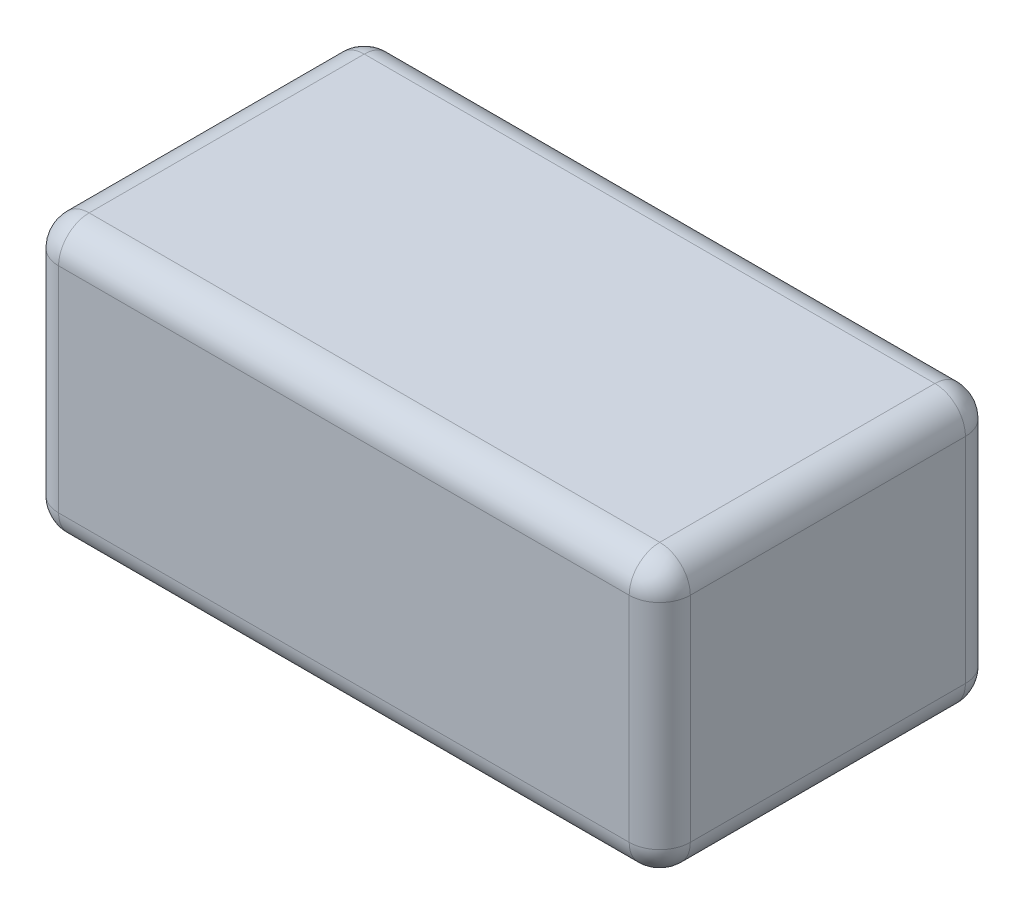
ISO-10303-21;
HEADER;
FILE_DESCRIPTION(('STEP AP214'),'2;1');
FILE_NAME('part.step','',(''),(''),'','','');
FILE_SCHEMA(('AUTOMOTIVE_DESIGN { 1 0 10303 214 1 1 1 1 }'));
ENDSEC;
DATA;
#1=APPLICATION_CONTEXT('core data for automotive mechanical design processes');
#2=APPLICATION_PROTOCOL_DEFINITION('international standard','automotive_design',2000,#1);
#3=PRODUCT_CONTEXT('',#1,'mechanical');
#4=PRODUCT('Part','Part','',(#3));
#5=PRODUCT_RELATED_PRODUCT_CATEGORY('part','',(#4));
#6=PRODUCT_DEFINITION_FORMATION('','',#4);
#7=PRODUCT_DEFINITION_CONTEXT('part definition',#1,'design');
#8=PRODUCT_DEFINITION('design','',#6,#7);
#9=PRODUCT_DEFINITION_SHAPE('','',#8);
#10=(LENGTH_UNIT() NAMED_UNIT(*) SI_UNIT(.MILLI.,.METRE.));
#11=(NAMED_UNIT(*) PLANE_ANGLE_UNIT() SI_UNIT($,.RADIAN.));
#12=(NAMED_UNIT(*) SI_UNIT($,.STERADIAN.) SOLID_ANGLE_UNIT());
#13=UNCERTAINTY_MEASURE_WITH_UNIT(LENGTH_MEASURE(1.E-05),#10,'distance_accuracy_value','');
#14=(GEOMETRIC_REPRESENTATION_CONTEXT(3) GLOBAL_UNCERTAINTY_ASSIGNED_CONTEXT((#13)) GLOBAL_UNIT_ASSIGNED_CONTEXT((#10,
#11,#12)) REPRESENTATION_CONTEXT('',''));
#15=CARTESIAN_POINT('',(0.,0.,0.));
#16=DIRECTION('',(0.,0.,1.));
#17=DIRECTION('',(1.,0.,0.));
#18=AXIS2_PLACEMENT_3D('',#15,#16,#17);
#19=CARTESIAN_POINT('',(-62.,0.,0.));
#20=DIRECTION('',(0.,0.,-1.));
#21=DIRECTION('',(-1.,0.,0.));
#22=AXIS2_PLACEMENT_3D('',#19,#20,#21);
#23=PLANE('',#22);
#24=DIRECTION('',(1.,0.,0.));
#25=VECTOR('',#24,1.);
#26=CARTESIAN_POINT('',(-62.,3.,0.));
#27=LINE('',#26,#25);
#28=CARTESIAN_POINT('',(-3.,3.,0.));
#29=VERTEX_POINT('',#28);
#30=CARTESIAN_POINT('',(-59.,3.,0.));
#31=VERTEX_POINT('',#30);
#32=EDGE_CURVE('E135',#29,#31,#27,.F.);
#33=ORIENTED_EDGE('',*,*,#32,.T.);
#34=DIRECTION('',(0.,1.,0.));
#35=VECTOR('',#34,1.);
#36=CARTESIAN_POINT('',(-59.,27.,0.));
#37=LINE('',#36,#35);
#38=CARTESIAN_POINT('',(-59.,24.,0.));
#39=VERTEX_POINT('',#38);
#40=EDGE_CURVE('E180',#31,#39,#37,.T.);
#41=ORIENTED_EDGE('',*,*,#40,.T.);
#42=DIRECTION('',(1.,0.,0.));
#43=VECTOR('',#42,1.);
#44=CARTESIAN_POINT('',(-62.,24.,0.));
#45=LINE('',#44,#43);
#46=CARTESIAN_POINT('',(-3.,24.,0.));
#47=VERTEX_POINT('',#46);
#48=EDGE_CURVE('E171',#39,#47,#45,.T.);
#49=ORIENTED_EDGE('',*,*,#48,.T.);
#50=DIRECTION('',(0.,1.,0.));
#51=VECTOR('',#50,1.);
#52=CARTESIAN_POINT('',(-3.,0.,0.));
#53=LINE('',#52,#51);
#54=EDGE_CURVE('E167',#47,#29,#53,.F.);
#55=ORIENTED_EDGE('',*,*,#54,.T.);
#56=EDGE_LOOP('',(#33,#41,#49,#55));
#57=FACE_BOUND('',#56,.T.);
#58=ADVANCED_FACE('F39',(#57),#23,.T.);
#59=CARTESIAN_POINT('',(-62.,0.,0.));
#60=DIRECTION('',(0.,-1.,0.));
#61=DIRECTION('',(0.,0.,-1.));
#62=AXIS2_PLACEMENT_3D('',#59,#60,#61);
#63=PLANE('',#62);
#64=DIRECTION('',(0.,0.,-1.));
#65=VECTOR('',#64,1.);
#66=CARTESIAN_POINT('',(-59.,0.,0.));
#67=LINE('',#66,#65);
#68=CARTESIAN_POINT('',(-59.,0.,30.));
#69=VERTEX_POINT('',#68);
#70=CARTESIAN_POINT('',(-59.,0.,3.));
#71=VERTEX_POINT('',#70);
#72=EDGE_CURVE('E164',#69,#71,#67,.T.);
#73=ORIENTED_EDGE('',*,*,#72,.T.);
#74=DIRECTION('',(1.,0.,0.));
#75=VECTOR('',#74,1.);
#76=CARTESIAN_POINT('',(-62.,0.,3.));
#77=LINE('',#76,#75);
#78=CARTESIAN_POINT('',(-3.,0.,3.));
#79=VERTEX_POINT('',#78);
#80=EDGE_CURVE('E133',#71,#79,#77,.T.);
#81=ORIENTED_EDGE('',*,*,#80,.T.);
#82=DIRECTION('',(0.,0.,-1.));
#83=VECTOR('',#82,1.);
#84=CARTESIAN_POINT('',(-3.,0.,0.));
#85=LINE('',#84,#83);
#86=CARTESIAN_POINT('',(-3.,0.,30.));
#87=VERTEX_POINT('',#86);
#88=EDGE_CURVE('E153',#79,#87,#85,.F.);
#89=ORIENTED_EDGE('',*,*,#88,.T.);
#90=DIRECTION('',(1.,0.,0.));
#91=VECTOR('',#90,1.);
#92=CARTESIAN_POINT('',(-62.,0.,30.));
#93=LINE('',#92,#91);
#94=EDGE_CURVE('E160',#87,#69,#93,.F.);
#95=ORIENTED_EDGE('',*,*,#94,.T.);
#96=EDGE_LOOP('',(#73,#81,#89,#95));
#97=FACE_BOUND('',#96,.T.);
#98=ADVANCED_FACE('F162',(#97),#63,.T.);
#99=CARTESIAN_POINT('',(-62.,0.,33.));
#100=DIRECTION('',(0.,0.,1.));
#101=DIRECTION('',(1.,0.,0.));
#102=AXIS2_PLACEMENT_3D('',#99,#100,#101);
#103=PLANE('',#102);
#104=DIRECTION('',(1.,0.,0.));
#105=VECTOR('',#104,1.);
#106=CARTESIAN_POINT('',(-62.,24.,33.));
#107=LINE('',#106,#105);
#108=CARTESIAN_POINT('',(-3.,24.,33.));
#109=VERTEX_POINT('',#108);
#110=CARTESIAN_POINT('',(-59.,24.,33.));
#111=VERTEX_POINT('',#110);
#112=EDGE_CURVE('E199',#109,#111,#107,.F.);
#113=ORIENTED_EDGE('',*,*,#112,.T.);
#114=DIRECTION('',(0.,-1.,0.));
#115=VECTOR('',#114,1.);
#116=CARTESIAN_POINT('',(-59.,0.,33.));
#117=LINE('',#116,#115);
#118=CARTESIAN_POINT('',(-59.,2.99999999999998,33.));
#119=VERTEX_POINT('',#118);
#120=EDGE_CURVE('E206',#111,#119,#117,.T.);
#121=ORIENTED_EDGE('',*,*,#120,.T.);
#122=DIRECTION('',(1.,0.,0.));
#123=VECTOR('',#122,1.);
#124=CARTESIAN_POINT('',(-62.,2.99999999999998,33.));
#125=LINE('',#124,#123);
#126=CARTESIAN_POINT('',(-3.,2.99999999999998,33.));
#127=VERTEX_POINT('',#126);
#128=EDGE_CURVE('E202',#119,#127,#125,.T.);
#129=ORIENTED_EDGE('',*,*,#128,.T.);
#130=DIRECTION('',(0.,-1.,0.));
#131=VECTOR('',#130,1.);
#132=CARTESIAN_POINT('',(-3.,0.,33.));
#133=LINE('',#132,#131);
#134=EDGE_CURVE('E196',#127,#109,#133,.F.);
#135=ORIENTED_EDGE('',*,*,#134,.T.);
#136=EDGE_LOOP('',(#113,#121,#129,#135));
#137=FACE_BOUND('',#136,.T.);
#138=ADVANCED_FACE('F332',(#137),#103,.T.);
#139=CARTESIAN_POINT('',(-62.,27.,0.));
#140=DIRECTION('',(0.,1.,0.));
#141=DIRECTION('',(0.,0.,1.));
#142=AXIS2_PLACEMENT_3D('',#139,#140,#141);
#143=PLANE('',#142);
#144=DIRECTION('',(0.,0.,1.));
#145=VECTOR('',#144,1.);
#146=CARTESIAN_POINT('',(-59.,27.,33.));
#147=LINE('',#146,#145);
#148=CARTESIAN_POINT('',(-59.,27.,3.));
#149=VERTEX_POINT('',#148);
#150=CARTESIAN_POINT('',(-59.,27.,30.));
#151=VERTEX_POINT('',#150);
#152=EDGE_CURVE('E49',#149,#151,#147,.T.);
#153=ORIENTED_EDGE('',*,*,#152,.T.);
#154=DIRECTION('',(1.,0.,0.));
#155=VECTOR('',#154,1.);
#156=CARTESIAN_POINT('',(-62.,27.,30.));
#157=LINE('',#156,#155);
#158=CARTESIAN_POINT('',(-3.,27.,30.));
#159=VERTEX_POINT('',#158);
#160=EDGE_CURVE('E11',#151,#159,#157,.T.);
#161=ORIENTED_EDGE('',*,*,#160,.T.);
#162=DIRECTION('',(0.,0.,1.));
#163=VECTOR('',#162,1.);
#164=CARTESIAN_POINT('',(-3.,27.,0.));
#165=LINE('',#164,#163);
#166=CARTESIAN_POINT('',(-3.,27.,3.));
#167=VERTEX_POINT('',#166);
#168=EDGE_CURVE('E222',#159,#167,#165,.F.);
#169=ORIENTED_EDGE('',*,*,#168,.T.);
#170=DIRECTION('',(1.,0.,0.));
#171=VECTOR('',#170,1.);
#172=CARTESIAN_POINT('',(-62.,27.,3.));
#173=LINE('',#172,#171);
#174=EDGE_CURVE('E60',#167,#149,#173,.F.);
#175=ORIENTED_EDGE('',*,*,#174,.T.);
#176=EDGE_LOOP('',(#153,#161,#169,#175));
#177=FACE_BOUND('',#176,.T.);
#178=ADVANCED_FACE('F344',(#177),#143,.T.);
#179=CARTESIAN_POINT('',(-62.,0.,0.));
#180=DIRECTION('',(1.,0.,0.));
#181=DIRECTION('',(0.,0.,-1.));
#182=AXIS2_PLACEMENT_3D('',#179,#180,#181);
#183=PLANE('',#182);
#184=DIRECTION('',(0.,0.,1.));
#185=VECTOR('',#184,1.);
#186=CARTESIAN_POINT('',(-62.,24.,0.));
#187=LINE('',#186,#185);
#188=CARTESIAN_POINT('',(-62.,24.,30.));
#189=VERTEX_POINT('',#188);
#190=CARTESIAN_POINT('',(-62.,24.,3.));
#191=VERTEX_POINT('',#190);
#192=EDGE_CURVE('E186',#189,#191,#187,.F.);
#193=ORIENTED_EDGE('',*,*,#192,.T.);
#194=DIRECTION('',(0.,1.,0.));
#195=VECTOR('',#194,1.);
#196=CARTESIAN_POINT('',(-62.,0.,3.));
#197=LINE('',#196,#195);
#198=CARTESIAN_POINT('',(-62.,3.,3.));
#199=VERTEX_POINT('',#198);
#200=EDGE_CURVE('E193',#191,#199,#197,.F.);
#201=ORIENTED_EDGE('',*,*,#200,.T.);
#202=DIRECTION('',(0.,0.,-1.));
#203=VECTOR('',#202,1.);
#204=CARTESIAN_POINT('',(-62.,2.99999999999998,33.));
#205=LINE('',#204,#203);
#206=CARTESIAN_POINT('',(-62.,2.99999999999998,30.));
#207=VERTEX_POINT('',#206);
#208=EDGE_CURVE('E189',#199,#207,#205,.F.);
#209=ORIENTED_EDGE('',*,*,#208,.T.);
#210=DIRECTION('',(0.,-1.,0.));
#211=VECTOR('',#210,1.);
#212=CARTESIAN_POINT('',(-62.,27.,30.));
#213=LINE('',#212,#211);
#214=EDGE_CURVE('E183',#207,#189,#213,.F.);
#215=ORIENTED_EDGE('',*,*,#214,.T.);
#216=EDGE_LOOP('',(#193,#201,#209,#215));
#217=FACE_BOUND('',#216,.T.);
#218=ADVANCED_FACE('F323',(#217),#183,.F.);
#219=CARTESIAN_POINT('',(0.,0.,0.));
#220=DIRECTION('',(1.,0.,0.));
#221=DIRECTION('',(0.,0.,-1.));
#222=AXIS2_PLACEMENT_3D('',#219,#220,#221);
#223=PLANE('',#222);
#224=DIRECTION('',(0.,0.,-1.));
#225=VECTOR('',#224,1.);
#226=CARTESIAN_POINT('',(0.,3.,0.));
#227=LINE('',#226,#225);
#228=CARTESIAN_POINT('',(0.,2.99999999999998,30.));
#229=VERTEX_POINT('',#228);
#230=CARTESIAN_POINT('',(0.,3.,3.));
#231=VERTEX_POINT('',#230);
#232=EDGE_CURVE('E215',#229,#231,#227,.T.);
#233=ORIENTED_EDGE('',*,*,#232,.T.);
#234=DIRECTION('',(0.,1.,0.));
#235=VECTOR('',#234,1.);
#236=CARTESIAN_POINT('',(0.,0.,3.));
#237=LINE('',#236,#235);
#238=CARTESIAN_POINT('',(0.,24.,3.));
#239=VERTEX_POINT('',#238);
#240=EDGE_CURVE('E219',#231,#239,#237,.T.);
#241=ORIENTED_EDGE('',*,*,#240,.T.);
#242=DIRECTION('',(0.,0.,1.));
#243=VECTOR('',#242,1.);
#244=CARTESIAN_POINT('',(0.,24.,0.));
#245=LINE('',#244,#243);
#246=CARTESIAN_POINT('',(0.,24.,30.));
#247=VERTEX_POINT('',#246);
#248=EDGE_CURVE('E212',#239,#247,#245,.T.);
#249=ORIENTED_EDGE('',*,*,#248,.T.);
#250=DIRECTION('',(0.,-1.,0.));
#251=VECTOR('',#250,1.);
#252=CARTESIAN_POINT('',(0.,0.,30.));
#253=LINE('',#252,#251);
#254=EDGE_CURVE('E209',#247,#229,#253,.T.);
#255=ORIENTED_EDGE('',*,*,#254,.T.);
#256=EDGE_LOOP('',(#233,#241,#249,#255));
#257=FACE_BOUND('',#256,.T.);
#258=ADVANCED_FACE('F531',(#257),#223,.T.);
#259=CARTESIAN_POINT('',(-62.,24.,30.));
#260=DIRECTION('',(1.,0.,0.));
#261=DIRECTION('',(0.,0.,-1.));
#262=AXIS2_PLACEMENT_3D('',#259,#260,#261);
#263=CYLINDRICAL_SURFACE('',#262,3.);
#264=CARTESIAN_POINT('',(-59.,24.,30.));
#265=DIRECTION('',(-1.,0.,0.));
#266=DIRECTION('',(0.,0.,1.));
#267=AXIS2_PLACEMENT_3D('',#264,#265,#266);
#268=CIRCLE('',#267,3.);
#269=EDGE_CURVE('E43',#111,#151,#268,.T.);
#270=ORIENTED_EDGE('',*,*,#269,.F.);
#271=ORIENTED_EDGE('',*,*,#112,.F.);
#272=CARTESIAN_POINT('',(-3.,24.,30.));
#273=DIRECTION('',(1.,0.,0.));
#274=DIRECTION('',(0.,0.,-1.));
#275=AXIS2_PLACEMENT_3D('',#272,#273,#274);
#276=CIRCLE('',#275,3.);
#277=EDGE_CURVE('E299',#159,#109,#276,.T.);
#278=ORIENTED_EDGE('',*,*,#277,.F.);
#279=ORIENTED_EDGE('',*,*,#160,.F.);
#280=EDGE_LOOP('',(#270,#271,#278,#279));
#281=FACE_BOUND('',#280,.T.);
#282=ADVANCED_FACE('F41',(#281),#263,.T.);
#283=CARTESIAN_POINT('',(-59.,24.,30.));
#284=DIRECTION('',(0.,1.,0.));
#285=DIRECTION('',(0.,0.,1.));
#286=AXIS2_PLACEMENT_3D('',#283,#284,#285);
#287=SPHERICAL_SURFACE('',#286,3.);
#288=CARTESIAN_POINT('',(-59.,24.,30.));
#289=DIRECTION('',(0.,1.,0.));
#290=DIRECTION('',(0.,0.,1.));
#291=AXIS2_PLACEMENT_3D('',#288,#289,#290);
#292=CIRCLE('',#291,3.);
#293=EDGE_CURVE('E292',#111,#189,#292,.F.);
#294=ORIENTED_EDGE('',*,*,#293,.F.);
#295=ORIENTED_EDGE('',*,*,#269,.T.);
#296=CARTESIAN_POINT('',(-59.,24.,30.));
#297=DIRECTION('',(0.,0.,1.));
#298=DIRECTION('',(1.,0.,0.));
#299=AXIS2_PLACEMENT_3D('',#296,#297,#298);
#300=CIRCLE('',#299,3.);
#301=EDGE_CURVE('E296',#189,#151,#300,.F.);
#302=ORIENTED_EDGE('',*,*,#301,.F.);
#303=EDGE_LOOP('',(#294,#295,#302));
#304=FACE_BOUND('',#303,.T.);
#305=ADVANCED_FACE('F312',(#304),#287,.T.);
#306=CARTESIAN_POINT('',(-3.,24.,30.));
#307=DIRECTION('',(0.,0.,1.));
#308=DIRECTION('',(1.,0.,0.));
#309=AXIS2_PLACEMENT_3D('',#306,#307,#308);
#310=SPHERICAL_SURFACE('',#309,3.);
#311=CARTESIAN_POINT('',(-3.,24.,30.));
#312=DIRECTION('',(0.,0.,1.));
#313=DIRECTION('',(1.,0.,0.));
#314=AXIS2_PLACEMENT_3D('',#311,#312,#313);
#315=CIRCLE('',#314,3.);
#316=EDGE_CURVE('E284',#159,#247,#315,.F.);
#317=ORIENTED_EDGE('',*,*,#316,.F.);
#318=ORIENTED_EDGE('',*,*,#277,.T.);
#319=CARTESIAN_POINT('',(-3.,24.,30.));
#320=DIRECTION('',(0.,1.,0.));
#321=DIRECTION('',(0.,0.,1.));
#322=AXIS2_PLACEMENT_3D('',#319,#320,#321);
#323=CIRCLE('',#322,3.);
#324=EDGE_CURVE('E288',#247,#109,#323,.F.);
#325=ORIENTED_EDGE('',*,*,#324,.F.);
#326=EDGE_LOOP('',(#317,#318,#325));
#327=FACE_BOUND('',#326,.T.);
#328=ADVANCED_FACE('F510',(#327),#310,.T.);
#329=CARTESIAN_POINT('',(-59.,24.,0.));
#330=DIRECTION('',(0.,0.,-1.));
#331=DIRECTION('',(0.,1.,0.));
#332=AXIS2_PLACEMENT_3D('',#329,#330,#331);
#333=CYLINDRICAL_SURFACE('',#332,3.);
#334=ORIENTED_EDGE('',*,*,#301,.T.);
#335=ORIENTED_EDGE('',*,*,#152,.F.);
#336=CARTESIAN_POINT('',(-59.,24.,3.));
#337=DIRECTION('',(0.,0.,-1.));
#338=DIRECTION('',(0.,1.,0.));
#339=AXIS2_PLACEMENT_3D('',#336,#337,#338);
#340=CIRCLE('',#339,3.);
#341=EDGE_CURVE('E276',#191,#149,#340,.T.);
#342=ORIENTED_EDGE('',*,*,#341,.F.);
#343=ORIENTED_EDGE('',*,*,#192,.F.);
#344=EDGE_LOOP('',(#334,#335,#342,#343));
#345=FACE_BOUND('',#344,.T.);
#346=ADVANCED_FACE('F318',(#345),#333,.T.);
#347=CARTESIAN_POINT('',(-59.,0.,30.));
#348=DIRECTION('',(0.,1.,0.));
#349=DIRECTION('',(0.,0.,1.));
#350=AXIS2_PLACEMENT_3D('',#347,#348,#349);
#351=CYLINDRICAL_SURFACE('',#350,3.);
#352=ORIENTED_EDGE('',*,*,#293,.T.);
#353=ORIENTED_EDGE('',*,*,#214,.F.);
#354=CARTESIAN_POINT('',(-59.,2.99999999999998,30.));
#355=DIRECTION('',(0.,-1.,0.));
#356=DIRECTION('',(0.,0.,-1.));
#357=AXIS2_PLACEMENT_3D('',#354,#355,#356);
#358=CIRCLE('',#357,3.);
#359=EDGE_CURVE('E272',#119,#207,#358,.T.);
#360=ORIENTED_EDGE('',*,*,#359,.F.);
#361=ORIENTED_EDGE('',*,*,#120,.F.);
#362=EDGE_LOOP('',(#352,#353,#360,#361));
#363=FACE_BOUND('',#362,.T.);
#364=ADVANCED_FACE('F329',(#363),#351,.T.);
#365=CARTESIAN_POINT('',(-62.,2.99999999999998,30.));
#366=DIRECTION('',(1.,0.,0.));
#367=DIRECTION('',(0.,0.,-1.));
#368=AXIS2_PLACEMENT_3D('',#365,#366,#367);
#369=CYLINDRICAL_SURFACE('',#368,3.);
#370=CARTESIAN_POINT('',(-3.,2.99999999999998,30.));
#371=DIRECTION('',(1.,0.,0.));
#372=DIRECTION('',(0.,0.,-1.));
#373=AXIS2_PLACEMENT_3D('',#370,#371,#372);
#374=CIRCLE('',#373,3.);
#375=EDGE_CURVE('E264',#127,#87,#374,.T.);
#376=ORIENTED_EDGE('',*,*,#375,.F.);
#377=ORIENTED_EDGE('',*,*,#128,.F.);
#378=CARTESIAN_POINT('',(-59.,2.99999999999998,30.));
#379=DIRECTION('',(-1.,0.,0.));
#380=DIRECTION('',(0.,0.,1.));
#381=AXIS2_PLACEMENT_3D('',#378,#379,#380);
#382=CIRCLE('',#381,3.);
#383=EDGE_CURVE('E268',#69,#119,#382,.T.);
#384=ORIENTED_EDGE('',*,*,#383,.F.);
#385=ORIENTED_EDGE('',*,*,#94,.F.);
#386=EDGE_LOOP('',(#376,#377,#384,#385));
#387=FACE_BOUND('',#386,.T.);
#388=ADVANCED_FACE('F336',(#387),#369,.T.);
#389=CARTESIAN_POINT('',(-3.,0.,30.));
#390=DIRECTION('',(0.,-1.,0.));
#391=DIRECTION('',(0.,0.,-1.));
#392=AXIS2_PLACEMENT_3D('',#389,#390,#391);
#393=CYLINDRICAL_SURFACE('',#392,3.);
#394=ORIENTED_EDGE('',*,*,#324,.T.);
#395=ORIENTED_EDGE('',*,*,#134,.F.);
#396=CARTESIAN_POINT('',(-3.,2.99999999999998,30.));
#397=DIRECTION('',(0.,-1.,0.));
#398=DIRECTION('',(0.,0.,-1.));
#399=AXIS2_PLACEMENT_3D('',#396,#397,#398);
#400=CIRCLE('',#399,3.);
#401=EDGE_CURVE('E261',#229,#127,#400,.T.);
#402=ORIENTED_EDGE('',*,*,#401,.F.);
#403=ORIENTED_EDGE('',*,*,#254,.F.);
#404=EDGE_LOOP('',(#394,#395,#402,#403));
#405=FACE_BOUND('',#404,.T.);
#406=ADVANCED_FACE('F342',(#405),#393,.T.);
#407=CARTESIAN_POINT('',(-3.,24.,0.));
#408=DIRECTION('',(0.,0.,1.));
#409=DIRECTION('',(0.,-1.,0.));
#410=AXIS2_PLACEMENT_3D('',#407,#408,#409);
#411=CYLINDRICAL_SURFACE('',#410,3.);
#412=ORIENTED_EDGE('',*,*,#316,.T.);
#413=ORIENTED_EDGE('',*,*,#248,.F.);
#414=CARTESIAN_POINT('',(-3.,24.,3.));
#415=DIRECTION('',(0.,0.,-1.));
#416=DIRECTION('',(0.,1.,0.));
#417=AXIS2_PLACEMENT_3D('',#414,#415,#416);
#418=CIRCLE('',#417,3.);
#419=EDGE_CURVE('E257',#167,#239,#418,.T.);
#420=ORIENTED_EDGE('',*,*,#419,.F.);
#421=ORIENTED_EDGE('',*,*,#168,.F.);
#422=EDGE_LOOP('',(#412,#413,#420,#421));
#423=FACE_BOUND('',#422,.T.);
#424=ADVANCED_FACE('F353',(#423),#411,.T.);
#425=CARTESIAN_POINT('',(-62.,24.,3.));
#426=DIRECTION('',(1.,0.,0.));
#427=DIRECTION('',(0.,0.,-1.));
#428=AXIS2_PLACEMENT_3D('',#425,#426,#427);
#429=CYLINDRICAL_SURFACE('',#428,3.);
#430=CARTESIAN_POINT('',(-59.,24.,3.));
#431=DIRECTION('',(-1.,0.,0.));
#432=DIRECTION('',(0.,0.,1.));
#433=AXIS2_PLACEMENT_3D('',#430,#431,#432);
#434=CIRCLE('',#433,3.);
#435=EDGE_CURVE('E280',#149,#39,#434,.T.);
#436=ORIENTED_EDGE('',*,*,#435,.F.);
#437=ORIENTED_EDGE('',*,*,#174,.F.);
#438=CARTESIAN_POINT('',(-3.,24.,3.));
#439=DIRECTION('',(1.,0.,0.));
#440=DIRECTION('',(0.,0.,-1.));
#441=AXIS2_PLACEMENT_3D('',#438,#439,#440);
#442=CIRCLE('',#441,3.);
#443=EDGE_CURVE('E253',#47,#167,#442,.T.);
#444=ORIENTED_EDGE('',*,*,#443,.F.);
#445=ORIENTED_EDGE('',*,*,#48,.F.);
#446=EDGE_LOOP('',(#436,#437,#444,#445));
#447=FACE_BOUND('',#446,.T.);
#448=ADVANCED_FACE('F349',(#447),#429,.T.);
#449=CARTESIAN_POINT('',(-59.,24.,3.));
#450=DIRECTION('',(0.,1.,0.));
#451=DIRECTION('',(0.,0.,1.));
#452=AXIS2_PLACEMENT_3D('',#449,#450,#451);
#453=SPHERICAL_SURFACE('',#452,3.);
#454=ORIENTED_EDGE('',*,*,#341,.T.);
#455=ORIENTED_EDGE('',*,*,#435,.T.);
#456=CARTESIAN_POINT('',(-59.,24.,3.));
#457=DIRECTION('',(0.,1.,0.));
#458=DIRECTION('',(0.,0.,1.));
#459=AXIS2_PLACEMENT_3D('',#456,#457,#458);
#460=CIRCLE('',#459,3.);
#461=EDGE_CURVE('E249',#191,#39,#460,.F.);
#462=ORIENTED_EDGE('',*,*,#461,.F.);
#463=EDGE_LOOP('',(#454,#455,#462));
#464=FACE_BOUND('',#463,.T.);
#465=ADVANCED_FACE('F362',(#464),#453,.T.);
#466=CARTESIAN_POINT('',(-59.,2.99999999999998,30.));
#467=DIRECTION('',(0.,0.,1.));
#468=DIRECTION('',(1.,0.,0.));
#469=AXIS2_PLACEMENT_3D('',#466,#467,#468);
#470=SPHERICAL_SURFACE('',#469,3.);
#471=ORIENTED_EDGE('',*,*,#383,.T.);
#472=ORIENTED_EDGE('',*,*,#359,.T.);
#473=CARTESIAN_POINT('',(-59.,2.99999999999998,30.));
#474=DIRECTION('',(0.,0.,1.));
#475=DIRECTION('',(1.,0.,0.));
#476=AXIS2_PLACEMENT_3D('',#473,#474,#475);
#477=CIRCLE('',#476,3.);
#478=EDGE_CURVE('E246',#69,#207,#477,.F.);
#479=ORIENTED_EDGE('',*,*,#478,.F.);
#480=EDGE_LOOP('',(#471,#472,#479));
#481=FACE_BOUND('',#480,.T.);
#482=ADVANCED_FACE('F372',(#481),#470,.T.);
#483=CARTESIAN_POINT('',(-3.,2.99999999999998,30.));
#484=DIRECTION('',(0.,0.,1.));
#485=DIRECTION('',(1.,0.,0.));
#486=AXIS2_PLACEMENT_3D('',#483,#484,#485);
#487=SPHERICAL_SURFACE('',#486,3.);
#488=ORIENTED_EDGE('',*,*,#401,.T.);
#489=ORIENTED_EDGE('',*,*,#375,.T.);
#490=CARTESIAN_POINT('',(-3.,2.99999999999998,30.));
#491=DIRECTION('',(0.,0.,1.));
#492=DIRECTION('',(1.,0.,0.));
#493=AXIS2_PLACEMENT_3D('',#490,#491,#492);
#494=CIRCLE('',#493,3.);
#495=EDGE_CURVE('E156',#229,#87,#494,.F.);
#496=ORIENTED_EDGE('',*,*,#495,.F.);
#497=EDGE_LOOP('',(#488,#489,#496));
#498=FACE_BOUND('',#497,.T.);
#499=ADVANCED_FACE('F374',(#498),#487,.T.);
#500=CARTESIAN_POINT('',(-3.,24.,3.));
#501=DIRECTION('',(0.,1.,0.));
#502=DIRECTION('',(0.,0.,1.));
#503=AXIS2_PLACEMENT_3D('',#500,#501,#502);
#504=SPHERICAL_SURFACE('',#503,3.);
#505=ORIENTED_EDGE('',*,*,#443,.T.);
#506=ORIENTED_EDGE('',*,*,#419,.T.);
#507=CARTESIAN_POINT('',(-3.,24.,3.));
#508=DIRECTION('',(0.,1.,0.));
#509=DIRECTION('',(0.,0.,1.));
#510=AXIS2_PLACEMENT_3D('',#507,#508,#509);
#511=CIRCLE('',#510,3.);
#512=EDGE_CURVE('E240',#47,#239,#511,.F.);
#513=ORIENTED_EDGE('',*,*,#512,.F.);
#514=EDGE_LOOP('',(#505,#506,#513));
#515=FACE_BOUND('',#514,.T.);
#516=ADVANCED_FACE('F355',(#515),#504,.T.);
#517=CARTESIAN_POINT('',(-59.,0.,3.));
#518=DIRECTION('',(0.,-1.,0.));
#519=DIRECTION('',(0.,0.,-1.));
#520=AXIS2_PLACEMENT_3D('',#517,#518,#519);
#521=CYLINDRICAL_SURFACE('',#520,3.);
#522=ORIENTED_EDGE('',*,*,#461,.T.);
#523=ORIENTED_EDGE('',*,*,#40,.F.);
#524=CARTESIAN_POINT('',(-59.,3.,3.));
#525=DIRECTION('',(0.,-1.,0.));
#526=DIRECTION('',(0.,0.,-1.));
#527=AXIS2_PLACEMENT_3D('',#524,#525,#526);
#528=CIRCLE('',#527,3.);
#529=EDGE_CURVE('E236',#199,#31,#528,.T.);
#530=ORIENTED_EDGE('',*,*,#529,.F.);
#531=ORIENTED_EDGE('',*,*,#200,.F.);
#532=EDGE_LOOP('',(#522,#523,#530,#531));
#533=FACE_BOUND('',#532,.T.);
#534=ADVANCED_FACE('F364',(#533),#521,.T.);
#535=CARTESIAN_POINT('',(-59.,3.,0.));
#536=DIRECTION('',(0.,0.,1.));
#537=DIRECTION('',(0.,-1.,0.));
#538=AXIS2_PLACEMENT_3D('',#535,#536,#537);
#539=CYLINDRICAL_SURFACE('',#538,3.);
#540=ORIENTED_EDGE('',*,*,#478,.T.);
#541=ORIENTED_EDGE('',*,*,#208,.F.);
#542=CARTESIAN_POINT('',(-59.,3.,3.));
#543=DIRECTION('',(0.,0.,-1.));
#544=DIRECTION('',(0.,1.,0.));
#545=AXIS2_PLACEMENT_3D('',#542,#543,#544);
#546=CIRCLE('',#545,3.);
#547=EDGE_CURVE('E150',#71,#199,#546,.T.);
#548=ORIENTED_EDGE('',*,*,#547,.F.);
#549=ORIENTED_EDGE('',*,*,#72,.F.);
#550=EDGE_LOOP('',(#540,#541,#548,#549));
#551=FACE_BOUND('',#550,.T.);
#552=ADVANCED_FACE('F370',(#551),#539,.T.);
#553=CARTESIAN_POINT('',(-3.,3.,0.));
#554=DIRECTION('',(0.,0.,-1.));
#555=DIRECTION('',(0.,1.,0.));
#556=AXIS2_PLACEMENT_3D('',#553,#554,#555);
#557=CYLINDRICAL_SURFACE('',#556,3.);
#558=ORIENTED_EDGE('',*,*,#495,.T.);
#559=ORIENTED_EDGE('',*,*,#88,.F.);
#560=CARTESIAN_POINT('',(-3.,3.,3.));
#561=DIRECTION('',(0.,0.,-1.));
#562=DIRECTION('',(0.,1.,0.));
#563=AXIS2_PLACEMENT_3D('',#560,#561,#562);
#564=CIRCLE('',#563,3.);
#565=EDGE_CURVE('E141',#231,#79,#564,.T.);
#566=ORIENTED_EDGE('',*,*,#565,.F.);
#567=ORIENTED_EDGE('',*,*,#232,.F.);
#568=EDGE_LOOP('',(#558,#559,#566,#567));
#569=FACE_BOUND('',#568,.T.);
#570=ADVANCED_FACE('F154',(#569),#557,.T.);
#571=CARTESIAN_POINT('',(-3.,0.,3.));
#572=DIRECTION('',(0.,1.,0.));
#573=DIRECTION('',(0.,0.,1.));
#574=AXIS2_PLACEMENT_3D('',#571,#572,#573);
#575=CYLINDRICAL_SURFACE('',#574,3.);
#576=ORIENTED_EDGE('',*,*,#512,.T.);
#577=ORIENTED_EDGE('',*,*,#240,.F.);
#578=CARTESIAN_POINT('',(-3.,3.,3.));
#579=DIRECTION('',(0.,-1.,0.));
#580=DIRECTION('',(0.,0.,-1.));
#581=AXIS2_PLACEMENT_3D('',#578,#579,#580);
#582=CIRCLE('',#581,3.);
#583=EDGE_CURVE('E145',#29,#231,#582,.T.);
#584=ORIENTED_EDGE('',*,*,#583,.F.);
#585=ORIENTED_EDGE('',*,*,#54,.F.);
#586=EDGE_LOOP('',(#576,#577,#584,#585));
#587=FACE_BOUND('',#586,.T.);
#588=ADVANCED_FACE('F358',(#587),#575,.T.);
#589=CARTESIAN_POINT('',(-59.,3.,3.));
#590=DIRECTION('',(-1.,0.,0.));
#591=DIRECTION('',(0.,0.,1.));
#592=AXIS2_PLACEMENT_3D('',#589,#590,#591);
#593=SPHERICAL_SURFACE('',#592,3.);
#594=ORIENTED_EDGE('',*,*,#547,.T.);
#595=ORIENTED_EDGE('',*,*,#529,.T.);
#596=CARTESIAN_POINT('',(-59.,3.,3.));
#597=DIRECTION('',(-1.,0.,0.));
#598=DIRECTION('',(0.,0.,1.));
#599=AXIS2_PLACEMENT_3D('',#596,#597,#598);
#600=CIRCLE('',#599,3.);
#601=EDGE_CURVE('E138',#71,#31,#600,.F.);
#602=ORIENTED_EDGE('',*,*,#601,.F.);
#603=EDGE_LOOP('',(#594,#595,#602));
#604=FACE_BOUND('',#603,.T.);
#605=ADVANCED_FACE('F368',(#604),#593,.T.);
#606=CARTESIAN_POINT('',(-3.,3.,3.));
#607=DIRECTION('',(1.,0.,0.));
#608=DIRECTION('',(0.,0.,-1.));
#609=AXIS2_PLACEMENT_3D('',#606,#607,#608);
#610=SPHERICAL_SURFACE('',#609,3.);
#611=ORIENTED_EDGE('',*,*,#583,.T.);
#612=ORIENTED_EDGE('',*,*,#565,.T.);
#613=CARTESIAN_POINT('',(-3.,3.,3.));
#614=DIRECTION('',(1.,0.,0.));
#615=DIRECTION('',(0.,0.,-1.));
#616=AXIS2_PLACEMENT_3D('',#613,#614,#615);
#617=CIRCLE('',#616,3.);
#618=EDGE_CURVE('E129',#29,#79,#617,.F.);
#619=ORIENTED_EDGE('',*,*,#618,.F.);
#620=EDGE_LOOP('',(#611,#612,#619));
#621=FACE_BOUND('',#620,.T.);
#622=ADVANCED_FACE('F143',(#621),#610,.T.);
#623=CARTESIAN_POINT('',(-62.,3.,3.));
#624=DIRECTION('',(1.,0.,0.));
#625=DIRECTION('',(0.,0.,-1.));
#626=AXIS2_PLACEMENT_3D('',#623,#624,#625);
#627=CYLINDRICAL_SURFACE('',#626,3.);
#628=ORIENTED_EDGE('',*,*,#601,.T.);
#629=ORIENTED_EDGE('',*,*,#32,.F.);
#630=ORIENTED_EDGE('',*,*,#618,.T.);
#631=ORIENTED_EDGE('',*,*,#80,.F.);
#632=EDGE_LOOP('',(#628,#629,#630,#631));
#633=FACE_BOUND('',#632,.T.);
#634=ADVANCED_FACE('F131',(#633),#627,.T.);
#635=CLOSED_SHELL('',(#58,#98,#138,#178,#218,#258,#282,#305,#328,#346,#364,#388,#406,#424,#448,
#465,#482,#499,#516,#534,#552,#570,#588,#605,#622,#634));
#636=MANIFOLD_SOLID_BREP('B2',#635);
#637=ADVANCED_BREP_SHAPE_REPRESENTATION('',(#18,#636),#14);
#638=SHAPE_DEFINITION_REPRESENTATION(#9,#637);
ENDSEC;
END-ISO-10303-21;
